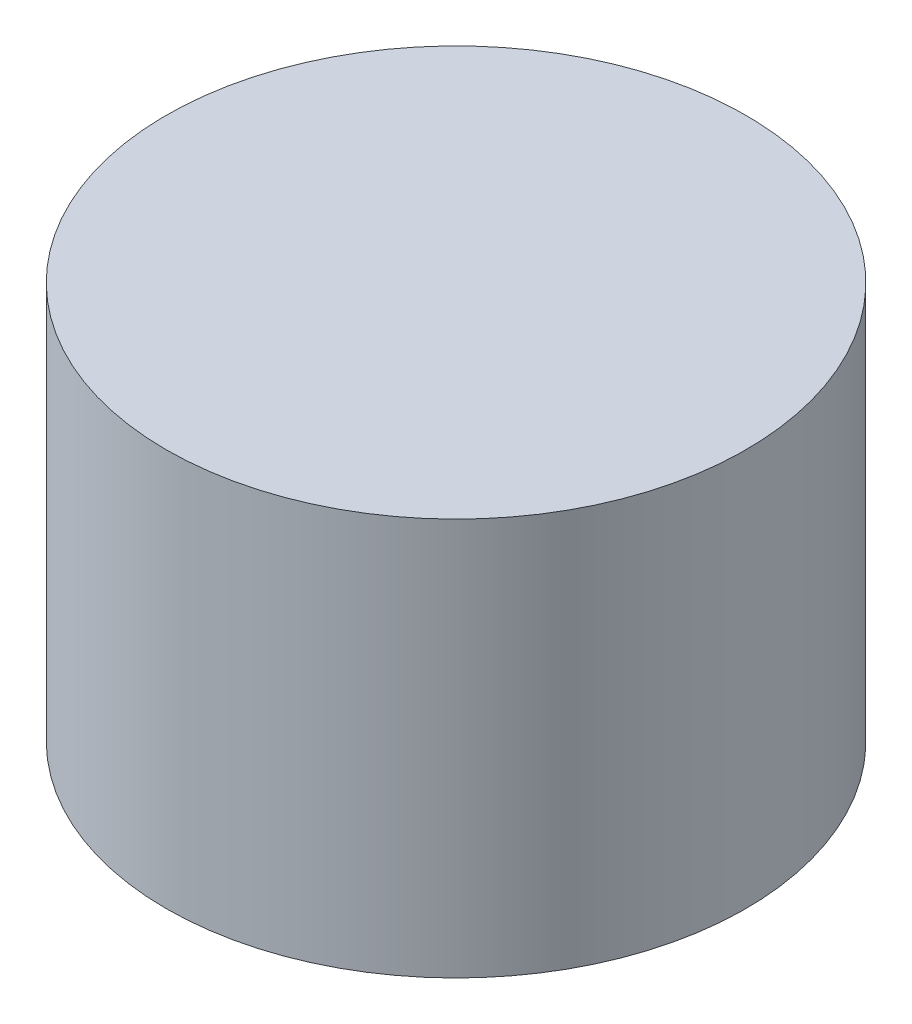
ISO-10303-21;
HEADER;
FILE_DESCRIPTION(('STEP AP214'),'2;1');
FILE_NAME('part.step','',(''),(''),'','','');
FILE_SCHEMA(('AUTOMOTIVE_DESIGN { 1 0 10303 214 1 1 1 1 }'));
ENDSEC;
DATA;
#1=APPLICATION_CONTEXT('core data for automotive mechanical design processes');
#2=APPLICATION_PROTOCOL_DEFINITION('international standard','automotive_design',2000,#1);
#3=PRODUCT_CONTEXT('',#1,'mechanical');
#4=PRODUCT('Part','Part','',(#3));
#5=PRODUCT_RELATED_PRODUCT_CATEGORY('part','',(#4));
#6=PRODUCT_DEFINITION_FORMATION('','',#4);
#7=PRODUCT_DEFINITION_CONTEXT('part definition',#1,'design');
#8=PRODUCT_DEFINITION('design','',#6,#7);
#9=PRODUCT_DEFINITION_SHAPE('','',#8);
#10=(LENGTH_UNIT() NAMED_UNIT(*) SI_UNIT(.MILLI.,.METRE.));
#11=(NAMED_UNIT(*) PLANE_ANGLE_UNIT() SI_UNIT($,.RADIAN.));
#12=(NAMED_UNIT(*) SI_UNIT($,.STERADIAN.) SOLID_ANGLE_UNIT());
#13=UNCERTAINTY_MEASURE_WITH_UNIT(LENGTH_MEASURE(1.E-05),#10,'distance_accuracy_value','');
#14=(GEOMETRIC_REPRESENTATION_CONTEXT(3) GLOBAL_UNCERTAINTY_ASSIGNED_CONTEXT((#13)) GLOBAL_UNIT_ASSIGNED_CONTEXT((#10,
#11,#12)) REPRESENTATION_CONTEXT('',''));
#15=CARTESIAN_POINT('',(0.,0.,0.));
#16=DIRECTION('',(0.,0.,1.));
#17=DIRECTION('',(1.,0.,0.));
#18=AXIS2_PLACEMENT_3D('',#15,#16,#17);
#19=CARTESIAN_POINT('',(0.,72.,0.));
#20=DIRECTION('',(0.,-1.,0.));
#21=DIRECTION('',(0.,0.,-1.));
#22=AXIS2_PLACEMENT_3D('',#19,#20,#21);
#23=CYLINDRICAL_SURFACE('',#22,52.5);
#24=CARTESIAN_POINT('',(0.,72.,0.));
#25=DIRECTION('',(0.,1.,0.));
#26=DIRECTION('',(0.,0.,1.));
#27=AXIS2_PLACEMENT_3D('',#24,#25,#26);
#28=CIRCLE('',#27,52.5);
#29=CARTESIAN_POINT('',(0.,72.,52.5));
#30=VERTEX_POINT('',#29);
#31=EDGE_CURVE('E10',#30,#30,#28,.T.);
#32=ORIENTED_EDGE('',*,*,#31,.F.);
#33=EDGE_LOOP('',(#32));
#34=FACE_BOUND('',#33,.T.);
#35=CARTESIAN_POINT('',(0.,0.,0.));
#36=DIRECTION('',(0.,1.,0.));
#37=DIRECTION('',(0.,0.,1.));
#38=AXIS2_PLACEMENT_3D('',#35,#36,#37);
#39=CIRCLE('',#38,52.5);
#40=CARTESIAN_POINT('',(0.,0.,52.5));
#41=VERTEX_POINT('',#40);
#42=EDGE_CURVE('E36',#41,#41,#39,.T.);
#43=ORIENTED_EDGE('',*,*,#42,.T.);
#44=EDGE_LOOP('',(#43));
#45=FACE_BOUND('',#44,.T.);
#46=ADVANCED_FACE('F33',(#34,#45),#23,.T.);
#47=CARTESIAN_POINT('',(0.,72.,0.));
#48=DIRECTION('',(0.,1.,0.));
#49=DIRECTION('',(0.,0.,1.));
#50=AXIS2_PLACEMENT_3D('',#47,#48,#49);
#51=PLANE('',#50);
#52=ORIENTED_EDGE('',*,*,#31,.T.);
#53=EDGE_LOOP('',(#52));
#54=FACE_BOUND('',#53,.T.);
#55=ADVANCED_FACE('F48',(#54),#51,.T.);
#56=CARTESIAN_POINT('',(0.,0.,0.));
#57=DIRECTION('',(0.,1.,0.));
#58=DIRECTION('',(0.,0.,1.));
#59=AXIS2_PLACEMENT_3D('',#56,#57,#58);
#60=PLANE('',#59);
#61=ORIENTED_EDGE('',*,*,#42,.F.);
#62=EDGE_LOOP('',(#61));
#63=FACE_BOUND('',#62,.T.);
#64=ADVANCED_FACE('F46',(#63),#60,.F.);
#65=CLOSED_SHELL('',(#46,#55,#64));
#66=MANIFOLD_SOLID_BREP('B2',#65);
#67=ADVANCED_BREP_SHAPE_REPRESENTATION('',(#18,#66),#14);
#68=SHAPE_DEFINITION_REPRESENTATION(#9,#67);
ENDSEC;
END-ISO-10303-21;
